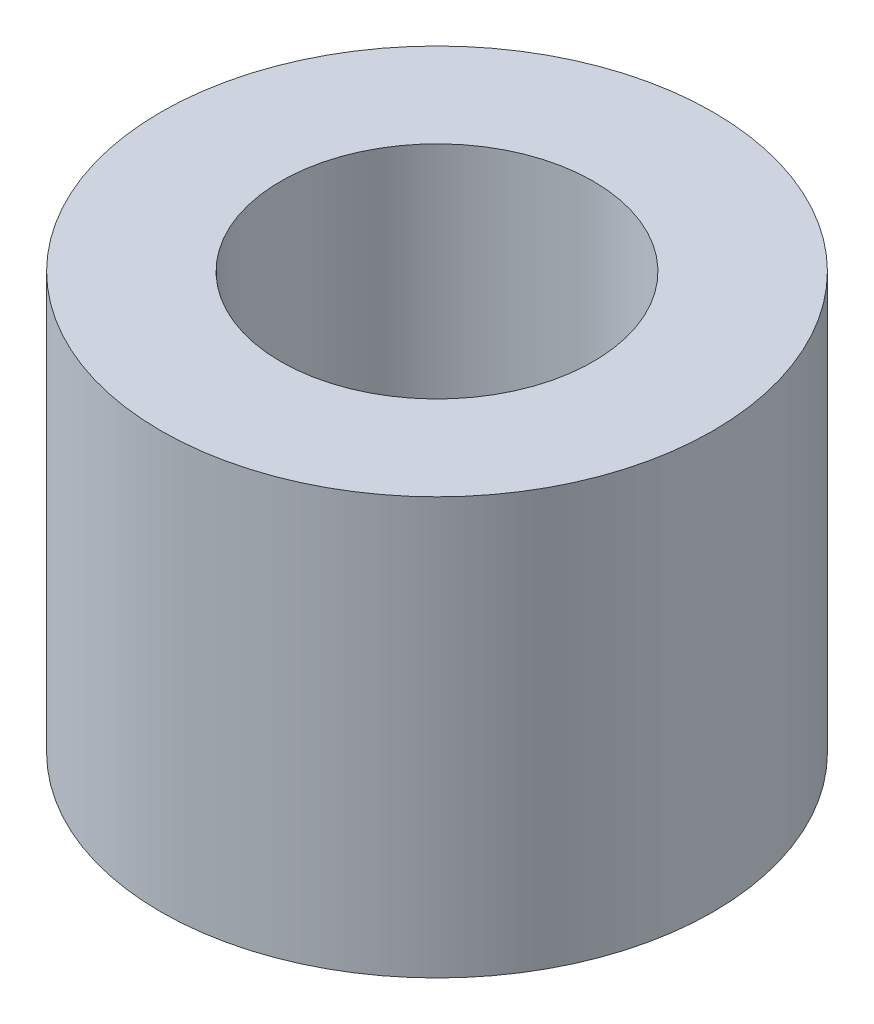
ISO-10303-21;
HEADER;
FILE_DESCRIPTION(('STEP AP214'),'2;1');
FILE_NAME('part.step','',(''),(''),'','','');
FILE_SCHEMA(('AUTOMOTIVE_DESIGN { 1 0 10303 214 1 1 1 1 }'));
ENDSEC;
DATA;
#1=APPLICATION_CONTEXT('core data for automotive mechanical design processes');
#2=APPLICATION_PROTOCOL_DEFINITION('international standard','automotive_design',2000,#1);
#3=PRODUCT_CONTEXT('',#1,'mechanical');
#4=PRODUCT('Part','Part','',(#3));
#5=PRODUCT_RELATED_PRODUCT_CATEGORY('part','',(#4));
#6=PRODUCT_DEFINITION_FORMATION('','',#4);
#7=PRODUCT_DEFINITION_CONTEXT('part definition',#1,'design');
#8=PRODUCT_DEFINITION('design','',#6,#7);
#9=PRODUCT_DEFINITION_SHAPE('','',#8);
#10=(LENGTH_UNIT() NAMED_UNIT(*) SI_UNIT(.MILLI.,.METRE.));
#11=(NAMED_UNIT(*) PLANE_ANGLE_UNIT() SI_UNIT($,.RADIAN.));
#12=(NAMED_UNIT(*) SI_UNIT($,.STERADIAN.) SOLID_ANGLE_UNIT());
#13=UNCERTAINTY_MEASURE_WITH_UNIT(LENGTH_MEASURE(1.E-05),#10,'distance_accuracy_value','');
#14=(GEOMETRIC_REPRESENTATION_CONTEXT(3) GLOBAL_UNCERTAINTY_ASSIGNED_CONTEXT((#13)) GLOBAL_UNIT_ASSIGNED_CONTEXT((#10,
#11,#12)) REPRESENTATION_CONTEXT('',''));
#15=CARTESIAN_POINT('',(0.,0.,0.));
#16=DIRECTION('',(0.,0.,1.));
#17=DIRECTION('',(1.,0.,0.));
#18=AXIS2_PLACEMENT_3D('',#15,#16,#17);
#19=CARTESIAN_POINT('',(0.,4.,0.));
#20=DIRECTION('',(0.,1.,0.));
#21=DIRECTION('',(0.,0.,1.));
#22=AXIS2_PLACEMENT_3D('',#19,#20,#21);
#23=PLANE('',#22);
#24=CARTESIAN_POINT('',(0.,4.,0.));
#25=DIRECTION('',(0.,1.,0.));
#26=DIRECTION('',(0.,0.,1.));
#27=AXIS2_PLACEMENT_3D('',#24,#25,#26);
#28=CIRCLE('',#27,2.65);
#29=CARTESIAN_POINT('',(0.,4.,2.65));
#30=VERTEX_POINT('',#29);
#31=EDGE_CURVE('E10',#30,#30,#28,.T.);
#32=ORIENTED_EDGE('',*,*,#31,.T.);
#33=EDGE_LOOP('',(#32));
#34=FACE_BOUND('',#33,.T.);
#35=CARTESIAN_POINT('',(0.,4.,0.));
#36=DIRECTION('',(0.,1.,0.));
#37=DIRECTION('',(0.,0.,1.));
#38=AXIS2_PLACEMENT_3D('',#35,#36,#37);
#39=CIRCLE('',#38,1.5);
#40=CARTESIAN_POINT('',(0.,4.,1.5));
#41=VERTEX_POINT('',#40);
#42=EDGE_CURVE('E46',#41,#41,#39,.T.);
#43=ORIENTED_EDGE('',*,*,#42,.F.);
#44=EDGE_LOOP('',(#43));
#45=FACE_BOUND('',#44,.T.);
#46=ADVANCED_FACE('F35',(#34,#45),#23,.T.);
#47=CARTESIAN_POINT('',(0.,0.,0.));
#48=DIRECTION('',(0.,1.,0.));
#49=DIRECTION('',(0.,0.,1.));
#50=AXIS2_PLACEMENT_3D('',#47,#48,#49);
#51=PLANE('',#50);
#52=CARTESIAN_POINT('',(0.,0.,0.));
#53=DIRECTION('',(0.,1.,0.));
#54=DIRECTION('',(0.,0.,1.));
#55=AXIS2_PLACEMENT_3D('',#52,#53,#54);
#56=CIRCLE('',#55,2.65);
#57=CARTESIAN_POINT('',(0.,0.,2.65));
#58=VERTEX_POINT('',#57);
#59=EDGE_CURVE('E39',#58,#58,#56,.T.);
#60=ORIENTED_EDGE('',*,*,#59,.F.);
#61=EDGE_LOOP('',(#60));
#62=FACE_BOUND('',#61,.T.);
#63=CARTESIAN_POINT('',(0.,0.,0.));
#64=DIRECTION('',(0.,1.,0.));
#65=DIRECTION('',(0.,0.,1.));
#66=AXIS2_PLACEMENT_3D('',#63,#64,#65);
#67=CIRCLE('',#66,1.5);
#68=CARTESIAN_POINT('',(0.,0.,1.5));
#69=VERTEX_POINT('',#68);
#70=EDGE_CURVE('E48',#69,#69,#67,.T.);
#71=ORIENTED_EDGE('',*,*,#70,.T.);
#72=EDGE_LOOP('',(#71));
#73=FACE_BOUND('',#72,.T.);
#74=ADVANCED_FACE('F58',(#62,#73),#51,.F.);
#75=CARTESIAN_POINT('',(0.,4.,0.));
#76=DIRECTION('',(0.,-1.,0.));
#77=DIRECTION('',(0.,0.,-1.));
#78=AXIS2_PLACEMENT_3D('',#75,#76,#77);
#79=CYLINDRICAL_SURFACE('',#78,2.65);
#80=ORIENTED_EDGE('',*,*,#31,.F.);
#81=EDGE_LOOP('',(#80));
#82=FACE_BOUND('',#81,.T.);
#83=ORIENTED_EDGE('',*,*,#59,.T.);
#84=EDGE_LOOP('',(#83));
#85=FACE_BOUND('',#84,.T.);
#86=ADVANCED_FACE('F37',(#82,#85),#79,.T.);
#87=CARTESIAN_POINT('',(0.,4.,0.));
#88=DIRECTION('',(0.,-1.,0.));
#89=DIRECTION('',(0.,0.,-1.));
#90=AXIS2_PLACEMENT_3D('',#87,#88,#89);
#91=CYLINDRICAL_SURFACE('',#90,1.5);
#92=ORIENTED_EDGE('',*,*,#42,.T.);
#93=EDGE_LOOP('',(#92));
#94=FACE_BOUND('',#93,.T.);
#95=ORIENTED_EDGE('',*,*,#70,.F.);
#96=EDGE_LOOP('',(#95));
#97=FACE_BOUND('',#96,.T.);
#98=ADVANCED_FACE('F54',(#94,#97),#91,.F.);
#99=CLOSED_SHELL('',(#46,#74,#86,#98));
#100=MANIFOLD_SOLID_BREP('B2',#99);
#101=ADVANCED_BREP_SHAPE_REPRESENTATION('',(#18,#100),#14);
#102=SHAPE_DEFINITION_REPRESENTATION(#9,#101);
ENDSEC;
END-ISO-10303-21;
